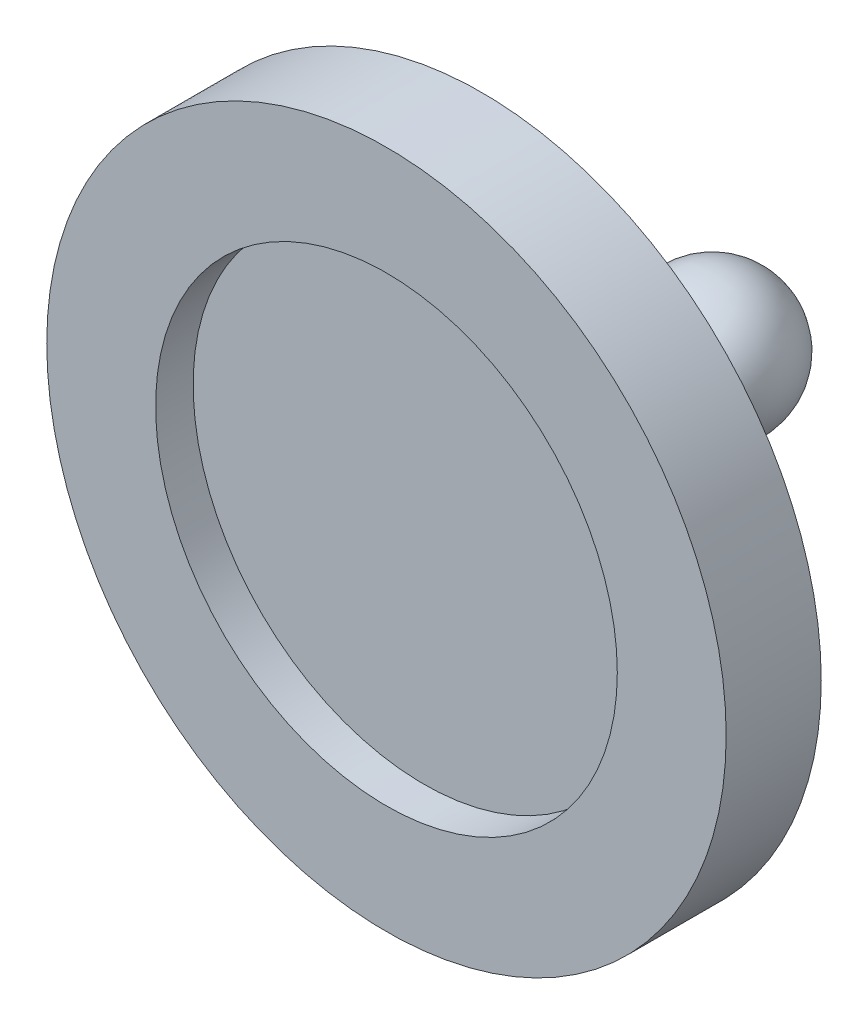
ISO-10303-21;
HEADER;
FILE_DESCRIPTION(('STEP AP214'),'2;1');
FILE_NAME('part.step','',(''),(''),'','','');
FILE_SCHEMA(('AUTOMOTIVE_DESIGN { 1 0 10303 214 1 1 1 1 }'));
ENDSEC;
DATA;
#1=APPLICATION_CONTEXT('core data for automotive mechanical design processes');
#2=APPLICATION_PROTOCOL_DEFINITION('international standard','automotive_design',2000,#1);
#3=PRODUCT_CONTEXT('',#1,'mechanical');
#4=PRODUCT('Part','Part','',(#3));
#5=PRODUCT_RELATED_PRODUCT_CATEGORY('part','',(#4));
#6=PRODUCT_DEFINITION_FORMATION('','',#4);
#7=PRODUCT_DEFINITION_CONTEXT('part definition',#1,'design');
#8=PRODUCT_DEFINITION('design','',#6,#7);
#9=PRODUCT_DEFINITION_SHAPE('','',#8);
#10=(LENGTH_UNIT() NAMED_UNIT(*) SI_UNIT(.MILLI.,.METRE.));
#11=(NAMED_UNIT(*) PLANE_ANGLE_UNIT() SI_UNIT($,.RADIAN.));
#12=(NAMED_UNIT(*) SI_UNIT($,.STERADIAN.) SOLID_ANGLE_UNIT());
#13=UNCERTAINTY_MEASURE_WITH_UNIT(LENGTH_MEASURE(1.E-05),#10,'distance_accuracy_value','');
#14=(GEOMETRIC_REPRESENTATION_CONTEXT(3) GLOBAL_UNCERTAINTY_ASSIGNED_CONTEXT((#13)) GLOBAL_UNIT_ASSIGNED_CONTEXT((#10,
#11,#12)) REPRESENTATION_CONTEXT('',''));
#15=CARTESIAN_POINT('',(0.,0.,0.));
#16=DIRECTION('',(0.,0.,1.));
#17=DIRECTION('',(1.,0.,0.));
#18=AXIS2_PLACEMENT_3D('',#15,#16,#17);
#19=CARTESIAN_POINT('',(0.,0.,-20.1701333918567));
#20=DIRECTION('',(0.,0.,1.));
#21=DIRECTION('',(1.,0.,0.));
#22=AXIS2_PLACEMENT_3D('',#19,#20,#21);
#23=SPHERICAL_SURFACE('',#22,3.23420050188906);
#24=CARTESIAN_POINT('',(0.,0.,-17.883208285254));
#25=DIRECTION('',(0.,0.,1.));
#26=DIRECTION('',(1.,0.,0.));
#27=AXIS2_PLACEMENT_3D('',#24,#25,#26);
#28=CIRCLE('',#27,2.28692510660272);
#29=CARTESIAN_POINT('',(2.28692510660272,0.,-17.883208285254));
#30=VERTEX_POINT('',#29);
#31=EDGE_CURVE('E53',#30,#30,#28,.T.);
#32=ORIENTED_EDGE('',*,*,#31,.F.);
#33=EDGE_LOOP('',(#32));
#34=FACE_BOUND('',#33,.T.);
#35=ADVANCED_FACE('F31',(#34),#23,.T.);
#36=CARTESIAN_POINT('',(10.6020935340857,0.,-6.92407564198066));
#37=DIRECTION('',(0.,0.,1.));
#38=DIRECTION('',(1.,0.,0.));
#39=AXIS2_PLACEMENT_3D('',#36,#37,#38);
#40=PLANE('',#39);
#41=CARTESIAN_POINT('',(0.,0.,-6.92407564198066));
#42=DIRECTION('',(0.,0.,1.));
#43=DIRECTION('',(1.,0.,0.));
#44=AXIS2_PLACEMENT_3D('',#41,#42,#43);
#45=CIRCLE('',#44,10.6020935340857);
#46=CARTESIAN_POINT('',(10.6020935340857,0.,-6.92407564198066));
#47=VERTEX_POINT('',#46);
#48=EDGE_CURVE('E10',#47,#47,#45,.T.);
#49=ORIENTED_EDGE('',*,*,#48,.T.);
#50=EDGE_LOOP('',(#49));
#51=FACE_BOUND('',#50,.T.);
#52=ADVANCED_FACE('F61',(#51),#40,.T.);
#53=CARTESIAN_POINT('',(0.,0.,0.));
#54=DIRECTION('',(0.,0.,1.));
#55=DIRECTION('',(1.,0.,0.));
#56=AXIS2_PLACEMENT_3D('',#53,#54,#55);
#57=CYLINDRICAL_SURFACE('',#56,10.6020935340857);
#58=CARTESIAN_POINT('',(0.,0.,-5.20121337955788));
#59=DIRECTION('',(0.,0.,1.));
#60=DIRECTION('',(1.,0.,0.));
#61=AXIS2_PLACEMENT_3D('',#58,#59,#60);
#62=CIRCLE('',#61,10.6020935340857);
#63=CARTESIAN_POINT('',(10.6020935340857,0.,-5.20121337955788));
#64=VERTEX_POINT('',#63);
#65=EDGE_CURVE('E37',#64,#64,#62,.T.);
#66=ORIENTED_EDGE('',*,*,#65,.T.);
#67=EDGE_LOOP('',(#66));
#68=FACE_BOUND('',#67,.T.);
#69=ORIENTED_EDGE('',*,*,#48,.F.);
#70=EDGE_LOOP('',(#69));
#71=FACE_BOUND('',#70,.T.);
#72=ADVANCED_FACE('F65',(#68,#71),#57,.F.);
#73=CARTESIAN_POINT('',(15.6020935340858,0.,-5.20121337955788));
#74=DIRECTION('',(0.,0.,1.));
#75=DIRECTION('',(1.,0.,0.));
#76=AXIS2_PLACEMENT_3D('',#73,#74,#75);
#77=PLANE('',#76);
#78=CARTESIAN_POINT('',(0.,0.,-5.20121337955788));
#79=DIRECTION('',(0.,0.,1.));
#80=DIRECTION('',(1.,0.,0.));
#81=AXIS2_PLACEMENT_3D('',#78,#79,#80);
#82=CIRCLE('',#81,15.6020935340858);
#83=CARTESIAN_POINT('',(15.6020935340858,0.,-5.20121337955788));
#84=VERTEX_POINT('',#83);
#85=EDGE_CURVE('E41',#84,#84,#82,.T.);
#86=ORIENTED_EDGE('',*,*,#85,.T.);
#87=EDGE_LOOP('',(#86));
#88=FACE_BOUND('',#87,.T.);
#89=ORIENTED_EDGE('',*,*,#65,.F.);
#90=EDGE_LOOP('',(#89));
#91=FACE_BOUND('',#90,.T.);
#92=ADVANCED_FACE('F69',(#88,#91),#77,.T.);
#93=CARTESIAN_POINT('',(0.,0.,0.));
#94=DIRECTION('',(0.,0.,1.));
#95=DIRECTION('',(1.,0.,0.));
#96=AXIS2_PLACEMENT_3D('',#93,#94,#95);
#97=CYLINDRICAL_SURFACE('',#96,15.6020935340858);
#98=CARTESIAN_POINT('',(0.,0.,-9.56803985777111));
#99=DIRECTION('',(0.,0.,1.));
#100=DIRECTION('',(1.,0.,0.));
#101=AXIS2_PLACEMENT_3D('',#98,#99,#100);
#102=CIRCLE('',#101,15.6020935340858);
#103=CARTESIAN_POINT('',(15.6020935340858,0.,-9.56803985777111));
#104=VERTEX_POINT('',#103);
#105=EDGE_CURVE('E45',#104,#104,#102,.T.);
#106=ORIENTED_EDGE('',*,*,#105,.T.);
#107=EDGE_LOOP('',(#106));
#108=FACE_BOUND('',#107,.T.);
#109=ORIENTED_EDGE('',*,*,#85,.F.);
#110=EDGE_LOOP('',(#109));
#111=FACE_BOUND('',#110,.T.);
#112=ADVANCED_FACE('F74',(#108,#111),#97,.T.);
#113=CARTESIAN_POINT('',(10.6020935340858,0.,-9.56803985777114));
#114=DIRECTION('',(0.,0.,-1.));
#115=DIRECTION('',(-1.,0.,0.));
#116=AXIS2_PLACEMENT_3D('',#113,#114,#115);
#117=PLANE('',#116);
#118=CARTESIAN_POINT('',(0.,0.,-9.56803985777117));
#119=DIRECTION('',(0.,0.,1.));
#120=DIRECTION('',(1.,0.,0.));
#121=AXIS2_PLACEMENT_3D('',#118,#119,#120);
#122=CIRCLE('',#121,10.6020935340858);
#123=CARTESIAN_POINT('',(10.6020935340858,0.,-9.56803985777117));
#124=VERTEX_POINT('',#123);
#125=EDGE_CURVE('E50',#124,#124,#122,.T.);
#126=ORIENTED_EDGE('',*,*,#125,.T.);
#127=EDGE_LOOP('',(#126));
#128=FACE_BOUND('',#127,.T.);
#129=ORIENTED_EDGE('',*,*,#105,.F.);
#130=EDGE_LOOP('',(#129));
#131=FACE_BOUND('',#130,.T.);
#132=ADVANCED_FACE('F78',(#128,#131),#117,.T.);
#133=CARTESIAN_POINT('',(0.,0.,-9.56803985777117));
#134=DIRECTION('',(0.,0.,1.));
#135=DIRECTION('',(1.,0.,0.));
#136=AXIS2_PLACEMENT_3D('',#133,#134,#135);
#137=CONICAL_SURFACE('',#136,10.6020935340858,0.78539816339746);
#138=ORIENTED_EDGE('',*,*,#31,.T.);
#139=EDGE_LOOP('',(#138));
#140=FACE_BOUND('',#139,.T.);
#141=ORIENTED_EDGE('',*,*,#125,.F.);
#142=EDGE_LOOP('',(#141));
#143=FACE_BOUND('',#142,.T.);
#144=ADVANCED_FACE('F57',(#140,#143),#137,.T.);
#145=CLOSED_SHELL('',(#35,#52,#72,#92,#112,#132,#144));
#146=MANIFOLD_SOLID_BREP('B2',#145);
#147=ADVANCED_BREP_SHAPE_REPRESENTATION('',(#18,#146),#14);
#148=SHAPE_DEFINITION_REPRESENTATION(#9,#147);
ENDSEC;
END-ISO-10303-21;
